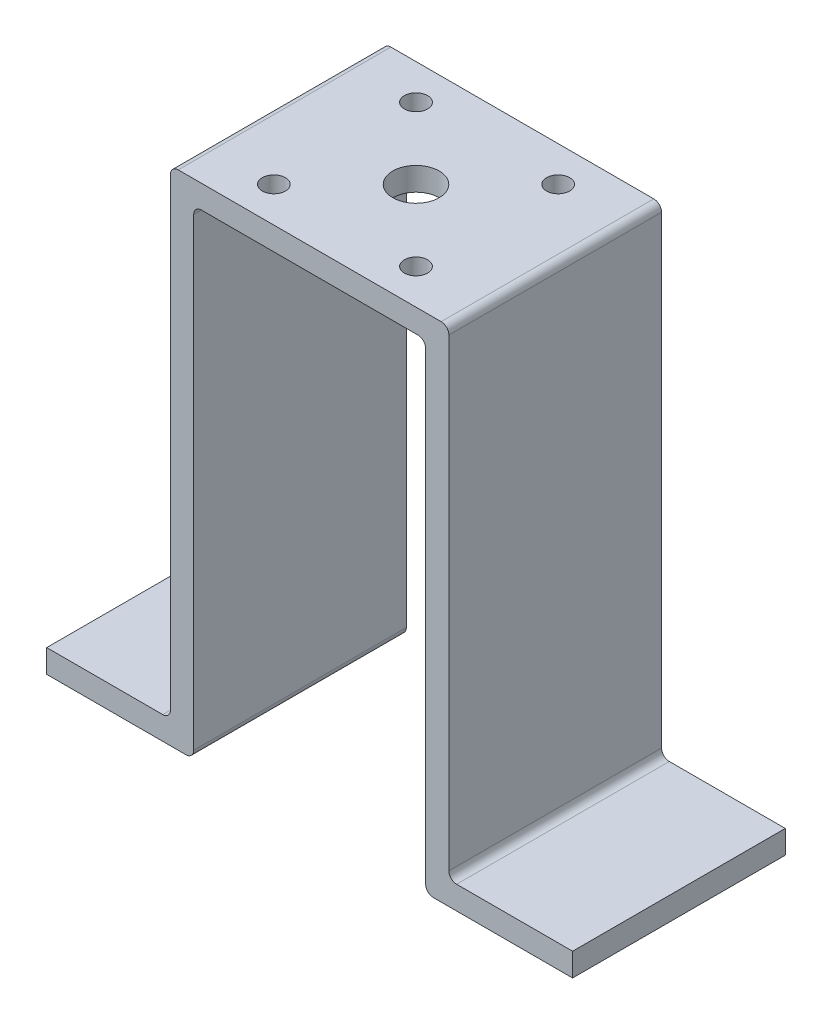
ISO-10303-21;
HEADER;
FILE_DESCRIPTION(('STEP AP214'),'2;1');
FILE_NAME('part.step','',(''),(''),'','','');
FILE_SCHEMA(('AUTOMOTIVE_DESIGN { 1 0 10303 214 1 1 1 1 }'));
ENDSEC;
DATA;
#1=APPLICATION_CONTEXT('core data for automotive mechanical design processes');
#2=APPLICATION_PROTOCOL_DEFINITION('international standard','automotive_design',2000,#1);
#3=PRODUCT_CONTEXT('',#1,'mechanical');
#4=PRODUCT('Part','Part','',(#3));
#5=PRODUCT_RELATED_PRODUCT_CATEGORY('part','',(#4));
#6=PRODUCT_DEFINITION_FORMATION('','',#4);
#7=PRODUCT_DEFINITION_CONTEXT('part definition',#1,'design');
#8=PRODUCT_DEFINITION('design','',#6,#7);
#9=PRODUCT_DEFINITION_SHAPE('','',#8);
#10=(LENGTH_UNIT() NAMED_UNIT(*) SI_UNIT(.MILLI.,.METRE.));
#11=(NAMED_UNIT(*) PLANE_ANGLE_UNIT() SI_UNIT($,.RADIAN.));
#12=(NAMED_UNIT(*) SI_UNIT($,.STERADIAN.) SOLID_ANGLE_UNIT());
#13=UNCERTAINTY_MEASURE_WITH_UNIT(LENGTH_MEASURE(1.E-05),#10,'distance_accuracy_value','');
#14=(GEOMETRIC_REPRESENTATION_CONTEXT(3) GLOBAL_UNCERTAINTY_ASSIGNED_CONTEXT((#13)) GLOBAL_UNIT_ASSIGNED_CONTEXT((#10,
#11,#12)) REPRESENTATION_CONTEXT('',''));
#15=CARTESIAN_POINT('',(0.,0.,0.));
#16=DIRECTION('',(0.,0.,1.));
#17=DIRECTION('',(1.,0.,0.));
#18=AXIS2_PLACEMENT_3D('',#15,#16,#17);
#19=CARTESIAN_POINT('',(-17.,40.2950334953585,13.75));
#20=DIRECTION('',(0.,-1.,0.));
#21=DIRECTION('',(0.,0.,-1.));
#22=AXIS2_PLACEMENT_3D('',#19,#20,#21);
#23=PLANE('',#22);
#24=CARTESIAN_POINT('',(-9.19,40.2950334953585,9.19));
#25=DIRECTION('',(0.,1.,0.));
#26=DIRECTION('',(0.,0.,1.));
#27=AXIS2_PLACEMENT_3D('',#24,#25,#26);
#28=CIRCLE('',#27,1.5);
#29=CARTESIAN_POINT('',(-9.19,40.2950334953585,10.69));
#30=VERTEX_POINT('',#29);
#31=EDGE_CURVE('E382',#30,#30,#28,.T.);
#32=ORIENTED_EDGE('',*,*,#31,.F.);
#33=EDGE_LOOP('',(#32));
#34=FACE_BOUND('',#33,.T.);
#35=CARTESIAN_POINT('',(9.19,40.2950334953585,9.19));
#36=DIRECTION('',(0.,1.,0.));
#37=DIRECTION('',(0.,0.,1.));
#38=AXIS2_PLACEMENT_3D('',#35,#36,#37);
#39=CIRCLE('',#38,1.5);
#40=CARTESIAN_POINT('',(9.19,40.2950334953585,10.69));
#41=VERTEX_POINT('',#40);
#42=EDGE_CURVE('E386',#41,#41,#39,.T.);
#43=ORIENTED_EDGE('',*,*,#42,.F.);
#44=EDGE_LOOP('',(#43));
#45=FACE_BOUND('',#44,.T.);
#46=CARTESIAN_POINT('',(9.19,40.2950334953585,-9.19));
#47=DIRECTION('',(0.,1.,0.));
#48=DIRECTION('',(0.,0.,1.));
#49=AXIS2_PLACEMENT_3D('',#46,#47,#48);
#50=CIRCLE('',#49,1.5);
#51=CARTESIAN_POINT('',(9.19,40.2950334953585,-7.69));
#52=VERTEX_POINT('',#51);
#53=EDGE_CURVE('E390',#52,#52,#50,.T.);
#54=ORIENTED_EDGE('',*,*,#53,.F.);
#55=EDGE_LOOP('',(#54));
#56=FACE_BOUND('',#55,.T.);
#57=CARTESIAN_POINT('',(-9.19,40.2950334953585,-9.19));
#58=DIRECTION('',(0.,1.,0.));
#59=DIRECTION('',(0.,0.,1.));
#60=AXIS2_PLACEMENT_3D('',#57,#58,#59);
#61=CIRCLE('',#60,1.5);
#62=CARTESIAN_POINT('',(-9.19,40.2950334953585,-7.69));
#63=VERTEX_POINT('',#62);
#64=EDGE_CURVE('E381',#63,#63,#61,.T.);
#65=ORIENTED_EDGE('',*,*,#64,.F.);
#66=EDGE_LOOP('',(#65));
#67=FACE_BOUND('',#66,.T.);
#68=CARTESIAN_POINT('',(0.,40.2950334953585,0.));
#69=DIRECTION('',(0.,1.,0.));
#70=DIRECTION('',(0.,0.,1.));
#71=AXIS2_PLACEMENT_3D('',#68,#69,#70);
#72=CIRCLE('',#71,3.);
#73=CARTESIAN_POINT('',(0.,40.2950334953585,3.));
#74=VERTEX_POINT('',#73);
#75=EDGE_CURVE('E224',#74,#74,#72,.T.);
#76=ORIENTED_EDGE('',*,*,#75,.F.);
#77=EDGE_LOOP('',(#76));
#78=FACE_BOUND('',#77,.T.);
#79=DIRECTION('',(-1.,0.,0.));
#80=VECTOR('',#79,1.);
#81=CARTESIAN_POINT('',(-17.,40.2950334953585,-13.75));
#82=LINE('',#81,#80);
#83=CARTESIAN_POINT('',(17.,40.2950334953585,-13.75));
#84=VERTEX_POINT('',#83);
#85=CARTESIAN_POINT('',(-17.,40.2950334953585,-13.75));
#86=VERTEX_POINT('',#85);
#87=EDGE_CURVE('E162',#84,#86,#82,.T.);
#88=ORIENTED_EDGE('',*,*,#87,.T.);
#89=DIRECTION('',(0.,0.,-1.));
#90=VECTOR('',#89,1.);
#91=CARTESIAN_POINT('',(-17.,40.2950334953585,13.75));
#92=LINE('',#91,#90);
#93=CARTESIAN_POINT('',(-17.,40.2950334953585,13.75));
#94=VERTEX_POINT('',#93);
#95=EDGE_CURVE('E11',#94,#86,#92,.T.);
#96=ORIENTED_EDGE('',*,*,#95,.F.);
#97=DIRECTION('',(-1.,0.,0.));
#98=VECTOR('',#97,1.);
#99=CARTESIAN_POINT('',(-17.,40.2950334953585,13.75));
#100=LINE('',#99,#98);
#101=CARTESIAN_POINT('',(17.,40.2950334953585,13.75));
#102=VERTEX_POINT('',#101);
#103=EDGE_CURVE('E108',#102,#94,#100,.T.);
#104=ORIENTED_EDGE('',*,*,#103,.F.);
#105=DIRECTION('',(0.,0.,-1.));
#106=VECTOR('',#105,1.);
#107=CARTESIAN_POINT('',(17.,40.2950334953585,13.75));
#108=LINE('',#107,#106);
#109=EDGE_CURVE('E285',#102,#84,#108,.T.);
#110=ORIENTED_EDGE('',*,*,#109,.T.);
#111=EDGE_LOOP('',(#88,#96,#104,#110));
#112=FACE_BOUND('',#111,.T.);
#113=ADVANCED_FACE('F39',(#34,#45,#56,#67,#78,#112),#23,.F.);
#114=CARTESIAN_POINT('',(-17.,39.2950334953585,13.75));
#115=DIRECTION('',(0.,0.,-1.));
#116=DIRECTION('',(-1.,0.,0.));
#117=AXIS2_PLACEMENT_3D('',#114,#115,#116);
#118=CYLINDRICAL_SURFACE('',#117,1.);
#119=CARTESIAN_POINT('',(-17.,39.2950334953585,-13.75));
#120=DIRECTION('',(0.,0.,1.));
#121=DIRECTION('',(-1.,0.,0.));
#122=AXIS2_PLACEMENT_3D('',#119,#120,#121);
#123=CIRCLE('',#122,1.);
#124=CARTESIAN_POINT('',(-18.,39.2950334953585,-13.75));
#125=VERTEX_POINT('',#124);
#126=EDGE_CURVE('E165',#86,#125,#123,.T.);
#127=ORIENTED_EDGE('',*,*,#126,.T.);
#128=DIRECTION('',(0.,0.,-1.));
#129=VECTOR('',#128,1.);
#130=CARTESIAN_POINT('',(-18.,39.2950334953585,13.75));
#131=LINE('',#130,#129);
#132=CARTESIAN_POINT('',(-18.,39.2950334953585,13.75));
#133=VERTEX_POINT('',#132);
#134=EDGE_CURVE('E49',#133,#125,#131,.T.);
#135=ORIENTED_EDGE('',*,*,#134,.F.);
#136=CARTESIAN_POINT('',(-17.,39.2950334953585,13.75));
#137=DIRECTION('',(0.,0.,1.));
#138=DIRECTION('',(-1.,0.,0.));
#139=AXIS2_PLACEMENT_3D('',#136,#137,#138);
#140=CIRCLE('',#139,1.);
#141=EDGE_CURVE('E326',#94,#133,#140,.T.);
#142=ORIENTED_EDGE('',*,*,#141,.F.);
#143=ORIENTED_EDGE('',*,*,#95,.T.);
#144=EDGE_LOOP('',(#127,#135,#142,#143));
#145=FACE_BOUND('',#144,.T.);
#146=ADVANCED_FACE('F403',(#145),#118,.T.);
#147=CARTESIAN_POINT('',(-18.,-20.7049665046415,13.75));
#148=DIRECTION('',(1.,0.,0.));
#149=DIRECTION('',(0.,1.,0.));
#150=AXIS2_PLACEMENT_3D('',#147,#148,#149);
#151=PLANE('',#150);
#152=DIRECTION('',(0.,-1.,0.));
#153=VECTOR('',#152,1.);
#154=CARTESIAN_POINT('',(-18.,-20.7049665046415,-13.75));
#155=LINE('',#154,#153);
#156=CARTESIAN_POINT('',(-18.,-20.7049665046415,-13.75));
#157=VERTEX_POINT('',#156);
#158=EDGE_CURVE('E169',#125,#157,#155,.T.);
#159=ORIENTED_EDGE('',*,*,#158,.T.);
#160=DIRECTION('',(0.,0.,-1.));
#161=VECTOR('',#160,1.);
#162=CARTESIAN_POINT('',(-18.,-20.7049665046415,13.75));
#163=LINE('',#162,#161);
#164=CARTESIAN_POINT('',(-18.,-20.7049665046415,13.75));
#165=VERTEX_POINT('',#164);
#166=EDGE_CURVE('E212',#165,#157,#163,.T.);
#167=ORIENTED_EDGE('',*,*,#166,.F.);
#168=DIRECTION('',(0.,-1.,0.));
#169=VECTOR('',#168,1.);
#170=CARTESIAN_POINT('',(-18.,-20.7049665046415,13.75));
#171=LINE('',#170,#169);
#172=EDGE_CURVE('E329',#133,#165,#171,.T.);
#173=ORIENTED_EDGE('',*,*,#172,.F.);
#174=ORIENTED_EDGE('',*,*,#134,.T.);
#175=EDGE_LOOP('',(#159,#167,#173,#174));
#176=FACE_BOUND('',#175,.T.);
#177=ADVANCED_FACE('F420',(#176),#151,.F.);
#178=CARTESIAN_POINT('',(-19.,-20.7049665046415,13.75));
#179=DIRECTION('',(0.,0.,-1.));
#180=DIRECTION('',(-1.,0.,0.));
#181=AXIS2_PLACEMENT_3D('',#178,#179,#180);
#182=CYLINDRICAL_SURFACE('',#181,1.);
#183=CARTESIAN_POINT('',(-19.,-20.7049665046415,-13.75));
#184=DIRECTION('',(0.,0.,-1.));
#185=DIRECTION('',(1.,0.,0.));
#186=AXIS2_PLACEMENT_3D('',#183,#184,#185);
#187=CIRCLE('',#186,1.);
#188=CARTESIAN_POINT('',(-19.,-21.7049665046415,-13.75));
#189=VERTEX_POINT('',#188);
#190=EDGE_CURVE('E172',#157,#189,#187,.T.);
#191=ORIENTED_EDGE('',*,*,#190,.T.);
#192=DIRECTION('',(0.,0.,-1.));
#193=VECTOR('',#192,1.);
#194=CARTESIAN_POINT('',(-19.,-21.7049665046415,13.75));
#195=LINE('',#194,#193);
#196=CARTESIAN_POINT('',(-19.,-21.7049665046415,13.75));
#197=VERTEX_POINT('',#196);
#198=EDGE_CURVE('E208',#197,#189,#195,.T.);
#199=ORIENTED_EDGE('',*,*,#198,.F.);
#200=CARTESIAN_POINT('',(-19.,-20.7049665046415,13.75));
#201=DIRECTION('',(0.,0.,-1.));
#202=DIRECTION('',(1.,0.,0.));
#203=AXIS2_PLACEMENT_3D('',#200,#201,#202);
#204=CIRCLE('',#203,1.);
#205=EDGE_CURVE('E332',#165,#197,#204,.T.);
#206=ORIENTED_EDGE('',*,*,#205,.F.);
#207=ORIENTED_EDGE('',*,*,#166,.T.);
#208=EDGE_LOOP('',(#191,#199,#206,#207));
#209=FACE_BOUND('',#208,.T.);
#210=ADVANCED_FACE('F424',(#209),#182,.F.);
#211=CARTESIAN_POINT('',(-34.,-21.7049665046415,13.75));
#212=DIRECTION('',(0.,-1.,0.));
#213=DIRECTION('',(1.,0.,0.));
#214=AXIS2_PLACEMENT_3D('',#211,#212,#213);
#215=PLANE('',#214);
#216=DIRECTION('',(-1.,0.,0.));
#217=VECTOR('',#216,1.);
#218=CARTESIAN_POINT('',(-34.,-21.7049665046415,-13.75));
#219=LINE('',#218,#217);
#220=CARTESIAN_POINT('',(-34.,-21.7049665046415,-13.75));
#221=VERTEX_POINT('',#220);
#222=EDGE_CURVE('E175',#189,#221,#219,.T.);
#223=ORIENTED_EDGE('',*,*,#222,.T.);
#224=DIRECTION('',(0.,0.,-1.));
#225=VECTOR('',#224,1.);
#226=CARTESIAN_POINT('',(-34.,-21.7049665046415,13.75));
#227=LINE('',#226,#225);
#228=CARTESIAN_POINT('',(-34.,-21.7049665046415,13.75));
#229=VERTEX_POINT('',#228);
#230=EDGE_CURVE('E204',#229,#221,#227,.T.);
#231=ORIENTED_EDGE('',*,*,#230,.F.);
#232=DIRECTION('',(-1.,0.,0.));
#233=VECTOR('',#232,1.);
#234=CARTESIAN_POINT('',(-34.,-21.7049665046415,13.75));
#235=LINE('',#234,#233);
#236=EDGE_CURVE('E335',#197,#229,#235,.T.);
#237=ORIENTED_EDGE('',*,*,#236,.F.);
#238=ORIENTED_EDGE('',*,*,#198,.T.);
#239=EDGE_LOOP('',(#223,#231,#237,#238));
#240=FACE_BOUND('',#239,.T.);
#241=ADVANCED_FACE('F431',(#240),#215,.F.);
#242=CARTESIAN_POINT('',(-34.,-24.7049665046415,13.75));
#243=DIRECTION('',(1.,0.,0.));
#244=DIRECTION('',(0.,0.,-1.));
#245=AXIS2_PLACEMENT_3D('',#242,#243,#244);
#246=PLANE('',#245);
#247=DIRECTION('',(0.,-1.,0.));
#248=VECTOR('',#247,1.);
#249=CARTESIAN_POINT('',(-34.,-24.7049665046415,-13.75));
#250=LINE('',#249,#248);
#251=CARTESIAN_POINT('',(-34.,-24.7049665046415,-13.75));
#252=VERTEX_POINT('',#251);
#253=EDGE_CURVE('E178',#221,#252,#250,.T.);
#254=ORIENTED_EDGE('',*,*,#253,.T.);
#255=DIRECTION('',(0.,0.,-1.));
#256=VECTOR('',#255,1.);
#257=CARTESIAN_POINT('',(-34.,-24.7049665046415,13.75));
#258=LINE('',#257,#256);
#259=CARTESIAN_POINT('',(-34.,-24.7049665046415,13.75));
#260=VERTEX_POINT('',#259);
#261=EDGE_CURVE('E200',#260,#252,#258,.T.);
#262=ORIENTED_EDGE('',*,*,#261,.F.);
#263=DIRECTION('',(0.,-1.,0.));
#264=VECTOR('',#263,1.);
#265=CARTESIAN_POINT('',(-34.,-24.7049665046415,13.75));
#266=LINE('',#265,#264);
#267=EDGE_CURVE('E338',#229,#260,#266,.T.);
#268=ORIENTED_EDGE('',*,*,#267,.F.);
#269=ORIENTED_EDGE('',*,*,#230,.T.);
#270=EDGE_LOOP('',(#254,#262,#268,#269));
#271=FACE_BOUND('',#270,.T.);
#272=ADVANCED_FACE('F434',(#271),#246,.F.);
#273=CARTESIAN_POINT('',(-16.,-24.7049665046415,13.75));
#274=DIRECTION('',(0.,1.,0.));
#275=DIRECTION('',(0.,0.,1.));
#276=AXIS2_PLACEMENT_3D('',#273,#274,#275);
#277=PLANE('',#276);
#278=DIRECTION('',(1.,0.,0.));
#279=VECTOR('',#278,1.);
#280=CARTESIAN_POINT('',(-16.,-24.7049665046415,-13.75));
#281=LINE('',#280,#279);
#282=CARTESIAN_POINT('',(-16.,-24.7049665046415,-13.75));
#283=VERTEX_POINT('',#282);
#284=EDGE_CURVE('E181',#252,#283,#281,.T.);
#285=ORIENTED_EDGE('',*,*,#284,.T.);
#286=DIRECTION('',(0.,0.,-1.));
#287=VECTOR('',#286,1.);
#288=CARTESIAN_POINT('',(-16.,-24.7049665046415,13.75));
#289=LINE('',#288,#287);
#290=CARTESIAN_POINT('',(-16.,-24.7049665046415,13.75));
#291=VERTEX_POINT('',#290);
#292=EDGE_CURVE('E148',#291,#283,#289,.T.);
#293=ORIENTED_EDGE('',*,*,#292,.F.);
#294=DIRECTION('',(1.,0.,0.));
#295=VECTOR('',#294,1.);
#296=CARTESIAN_POINT('',(-16.,-24.7049665046415,13.75));
#297=LINE('',#296,#295);
#298=EDGE_CURVE('E137',#260,#291,#297,.T.);
#299=ORIENTED_EDGE('',*,*,#298,.F.);
#300=ORIENTED_EDGE('',*,*,#261,.T.);
#301=EDGE_LOOP('',(#285,#293,#299,#300));
#302=FACE_BOUND('',#301,.T.);
#303=ADVANCED_FACE('F437',(#302),#277,.F.);
#304=CARTESIAN_POINT('',(-16.,-23.7049665046415,13.75));
#305=DIRECTION('',(0.,0.,-1.));
#306=DIRECTION('',(-1.,0.,0.));
#307=AXIS2_PLACEMENT_3D('',#304,#305,#306);
#308=CYLINDRICAL_SURFACE('',#307,1.);
#309=CARTESIAN_POINT('',(-16.,-23.7049665046415,-13.75));
#310=DIRECTION('',(0.,0.,1.));
#311=DIRECTION('',(-1.,0.,0.));
#312=AXIS2_PLACEMENT_3D('',#309,#310,#311);
#313=CIRCLE('',#312,1.);
#314=CARTESIAN_POINT('',(-15.,-23.7049665046415,-13.75));
#315=VERTEX_POINT('',#314);
#316=EDGE_CURVE('E146',#283,#315,#313,.T.);
#317=ORIENTED_EDGE('',*,*,#316,.T.);
#318=DIRECTION('',(0.,0.,-1.));
#319=VECTOR('',#318,1.);
#320=CARTESIAN_POINT('',(-15.,-23.7049665046415,13.75));
#321=LINE('',#320,#319);
#322=CARTESIAN_POINT('',(-15.,-23.7049665046415,13.75));
#323=VERTEX_POINT('',#322);
#324=EDGE_CURVE('E143',#323,#315,#321,.T.);
#325=ORIENTED_EDGE('',*,*,#324,.F.);
#326=CARTESIAN_POINT('',(-16.,-23.7049665046415,13.75));
#327=DIRECTION('',(0.,0.,1.));
#328=DIRECTION('',(-1.,0.,0.));
#329=AXIS2_PLACEMENT_3D('',#326,#327,#328);
#330=CIRCLE('',#329,1.);
#331=EDGE_CURVE('E131',#291,#323,#330,.T.);
#332=ORIENTED_EDGE('',*,*,#331,.F.);
#333=ORIENTED_EDGE('',*,*,#292,.T.);
#334=EDGE_LOOP('',(#317,#325,#332,#333));
#335=FACE_BOUND('',#334,.T.);
#336=ADVANCED_FACE('F144',(#335),#308,.T.);
#337=CARTESIAN_POINT('',(-15.,36.2950334953585,13.75));
#338=DIRECTION('',(-1.,0.,0.));
#339=DIRECTION('',(0.,-1.,0.));
#340=AXIS2_PLACEMENT_3D('',#337,#338,#339);
#341=PLANE('',#340);
#342=DIRECTION('',(0.,1.,0.));
#343=VECTOR('',#342,1.);
#344=CARTESIAN_POINT('',(-15.,36.2950334953585,-13.75));
#345=LINE('',#344,#343);
#346=CARTESIAN_POINT('',(-15.,36.2950334953585,-13.75));
#347=VERTEX_POINT('',#346);
#348=EDGE_CURVE('E94',#315,#347,#345,.T.);
#349=ORIENTED_EDGE('',*,*,#348,.T.);
#350=DIRECTION('',(0.,0.,-1.));
#351=VECTOR('',#350,1.);
#352=CARTESIAN_POINT('',(-15.,36.2950334953585,13.75));
#353=LINE('',#352,#351);
#354=CARTESIAN_POINT('',(-15.,36.2950334953585,13.75));
#355=VERTEX_POINT('',#354);
#356=EDGE_CURVE('E149',#355,#347,#353,.T.);
#357=ORIENTED_EDGE('',*,*,#356,.F.);
#358=DIRECTION('',(0.,1.,0.));
#359=VECTOR('',#358,1.);
#360=CARTESIAN_POINT('',(-15.,36.2950334953585,13.75));
#361=LINE('',#360,#359);
#362=EDGE_CURVE('E135',#323,#355,#361,.T.);
#363=ORIENTED_EDGE('',*,*,#362,.F.);
#364=ORIENTED_EDGE('',*,*,#324,.T.);
#365=EDGE_LOOP('',(#349,#357,#363,#364));
#366=FACE_BOUND('',#365,.T.);
#367=ADVANCED_FACE('F151',(#366),#341,.F.);
#368=CARTESIAN_POINT('',(-14.,36.2950334953585,13.75));
#369=DIRECTION('',(0.,0.,-1.));
#370=DIRECTION('',(-1.,0.,0.));
#371=AXIS2_PLACEMENT_3D('',#368,#369,#370);
#372=CYLINDRICAL_SURFACE('',#371,1.);
#373=CARTESIAN_POINT('',(-14.,36.2950334953585,-13.75));
#374=DIRECTION('',(0.,0.,-1.));
#375=DIRECTION('',(1.,0.,0.));
#376=AXIS2_PLACEMENT_3D('',#373,#374,#375);
#377=CIRCLE('',#376,1.);
#378=CARTESIAN_POINT('',(-14.,37.2950334953585,-13.75));
#379=VERTEX_POINT('',#378);
#380=EDGE_CURVE('E100',#347,#379,#377,.T.);
#381=ORIENTED_EDGE('',*,*,#380,.T.);
#382=DIRECTION('',(0.,0.,-1.));
#383=VECTOR('',#382,1.);
#384=CARTESIAN_POINT('',(-14.,37.2950334953585,13.75));
#385=LINE('',#384,#383);
#386=CARTESIAN_POINT('',(-14.,37.2950334953585,13.75));
#387=VERTEX_POINT('',#386);
#388=EDGE_CURVE('E161',#387,#379,#385,.T.);
#389=ORIENTED_EDGE('',*,*,#388,.F.);
#390=CARTESIAN_POINT('',(-14.,36.2950334953585,13.75));
#391=DIRECTION('',(0.,0.,-1.));
#392=DIRECTION('',(1.,0.,0.));
#393=AXIS2_PLACEMENT_3D('',#390,#391,#392);
#394=CIRCLE('',#393,1.);
#395=EDGE_CURVE('E58',#355,#387,#394,.T.);
#396=ORIENTED_EDGE('',*,*,#395,.F.);
#397=ORIENTED_EDGE('',*,*,#356,.T.);
#398=EDGE_LOOP('',(#381,#389,#396,#397));
#399=FACE_BOUND('',#398,.T.);
#400=ADVANCED_FACE('F532',(#399),#372,.F.);
#401=CARTESIAN_POINT('',(0.,37.2950334953585,13.75));
#402=DIRECTION('',(0.,1.,0.));
#403=DIRECTION('',(0.,0.,1.));
#404=AXIS2_PLACEMENT_3D('',#401,#402,#403);
#405=PLANE('',#404);
#406=CARTESIAN_POINT('',(-9.19,37.2950334953585,9.19));
#407=DIRECTION('',(0.,1.,0.));
#408=DIRECTION('',(0.,0.,1.));
#409=AXIS2_PLACEMENT_3D('',#406,#407,#408);
#410=CIRCLE('',#409,1.5);
#411=CARTESIAN_POINT('',(-9.19,37.2950334953585,10.69));
#412=VERTEX_POINT('',#411);
#413=EDGE_CURVE('E42',#412,#412,#410,.T.);
#414=ORIENTED_EDGE('',*,*,#413,.T.);
#415=EDGE_LOOP('',(#414));
#416=FACE_BOUND('',#415,.T.);
#417=CARTESIAN_POINT('',(9.19,37.2950334953585,9.19));
#418=DIRECTION('',(0.,1.,0.));
#419=DIRECTION('',(0.,0.,1.));
#420=AXIS2_PLACEMENT_3D('',#417,#418,#419);
#421=CIRCLE('',#420,1.5);
#422=CARTESIAN_POINT('',(9.19,37.2950334953585,10.69));
#423=VERTEX_POINT('',#422);
#424=EDGE_CURVE('E231',#423,#423,#421,.T.);
#425=ORIENTED_EDGE('',*,*,#424,.T.);
#426=EDGE_LOOP('',(#425));
#427=FACE_BOUND('',#426,.T.);
#428=CARTESIAN_POINT('',(9.19,37.2950334953585,-9.19));
#429=DIRECTION('',(0.,1.,0.));
#430=DIRECTION('',(0.,0.,1.));
#431=AXIS2_PLACEMENT_3D('',#428,#429,#430);
#432=CIRCLE('',#431,1.5);
#433=CARTESIAN_POINT('',(9.19,37.2950334953585,-7.69));
#434=VERTEX_POINT('',#433);
#435=EDGE_CURVE('E228',#434,#434,#432,.T.);
#436=ORIENTED_EDGE('',*,*,#435,.T.);
#437=EDGE_LOOP('',(#436));
#438=FACE_BOUND('',#437,.T.);
#439=CARTESIAN_POINT('',(-9.19,37.2950334953585,-9.19));
#440=DIRECTION('',(0.,1.,0.));
#441=DIRECTION('',(0.,0.,1.));
#442=AXIS2_PLACEMENT_3D('',#439,#440,#441);
#443=CIRCLE('',#442,1.5);
#444=CARTESIAN_POINT('',(-9.19,37.2950334953585,-7.69));
#445=VERTEX_POINT('',#444);
#446=EDGE_CURVE('E223',#445,#445,#443,.T.);
#447=ORIENTED_EDGE('',*,*,#446,.T.);
#448=EDGE_LOOP('',(#447));
#449=FACE_BOUND('',#448,.T.);
#450=CARTESIAN_POINT('',(0.,37.2950334953585,0.));
#451=DIRECTION('',(0.,1.,0.));
#452=DIRECTION('',(0.,0.,1.));
#453=AXIS2_PLACEMENT_3D('',#450,#451,#452);
#454=CIRCLE('',#453,3.);
#455=CARTESIAN_POINT('',(0.,37.2950334953585,3.));
#456=VERTEX_POINT('',#455);
#457=EDGE_CURVE('E219',#456,#456,#454,.T.);
#458=ORIENTED_EDGE('',*,*,#457,.T.);
#459=EDGE_LOOP('',(#458));
#460=FACE_BOUND('',#459,.T.);
#461=DIRECTION('',(1.,0.,0.));
#462=VECTOR('',#461,1.);
#463=CARTESIAN_POINT('',(0.,37.2950334953585,-13.75));
#464=LINE('',#463,#462);
#465=CARTESIAN_POINT('',(14.,37.2950334953585,-13.75));
#466=VERTEX_POINT('',#465);
#467=EDGE_CURVE('E190',#379,#466,#464,.T.);
#468=ORIENTED_EDGE('',*,*,#467,.T.);
#469=DIRECTION('',(0.,0.,-1.));
#470=VECTOR('',#469,1.);
#471=CARTESIAN_POINT('',(14.,37.2950334953585,13.75));
#472=LINE('',#471,#470);
#473=CARTESIAN_POINT('',(14.,37.2950334953585,13.75));
#474=VERTEX_POINT('',#473);
#475=EDGE_CURVE('E166',#474,#466,#472,.T.);
#476=ORIENTED_EDGE('',*,*,#475,.F.);
#477=DIRECTION('',(1.,0.,0.));
#478=VECTOR('',#477,1.);
#479=CARTESIAN_POINT('',(0.,37.2950334953585,13.75));
#480=LINE('',#479,#478);
#481=EDGE_CURVE('E155',#387,#474,#480,.T.);
#482=ORIENTED_EDGE('',*,*,#481,.F.);
#483=ORIENTED_EDGE('',*,*,#388,.T.);
#484=EDGE_LOOP('',(#468,#476,#482,#483));
#485=FACE_BOUND('',#484,.T.);
#486=ADVANCED_FACE('F440',(#416,#427,#438,#449,#460,#485),#405,.F.);
#487=CARTESIAN_POINT('',(-14.,36.2950334953585,13.75));
#488=DIRECTION('',(0.,0.,1.));
#489=DIRECTION('',(1.,0.,0.));
#490=AXIS2_PLACEMENT_3D('',#487,#488,#489);
#491=PLANE('',#490);
#492=ORIENTED_EDGE('',*,*,#481,.T.);
#493=CARTESIAN_POINT('',(14.,36.2950334953585,13.75));
#494=DIRECTION('',(0.,0.,1.));
#495=DIRECTION('',(-1.,0.,0.));
#496=AXIS2_PLACEMENT_3D('',#493,#494,#495);
#497=CIRCLE('',#496,1.);
#498=CARTESIAN_POINT('',(15.,36.2950334953585,13.75));
#499=VERTEX_POINT('',#498);
#500=EDGE_CURVE('E284',#499,#474,#497,.T.);
#501=ORIENTED_EDGE('',*,*,#500,.F.);
#502=DIRECTION('',(0.,1.,0.));
#503=VECTOR('',#502,1.);
#504=CARTESIAN_POINT('',(15.,36.2950334953585,13.75));
#505=LINE('',#504,#503);
#506=CARTESIAN_POINT('',(15.,-23.7049665046415,13.75));
#507=VERTEX_POINT('',#506);
#508=EDGE_CURVE('E366',#507,#499,#505,.T.);
#509=ORIENTED_EDGE('',*,*,#508,.F.);
#510=CARTESIAN_POINT('',(16.,-23.7049665046415,13.75));
#511=DIRECTION('',(0.,0.,-1.));
#512=DIRECTION('',(1.,0.,0.));
#513=AXIS2_PLACEMENT_3D('',#510,#511,#512);
#514=CIRCLE('',#513,1.);
#515=CARTESIAN_POINT('',(16.,-24.7049665046415,13.75));
#516=VERTEX_POINT('',#515);
#517=EDGE_CURVE('E362',#516,#507,#514,.T.);
#518=ORIENTED_EDGE('',*,*,#517,.F.);
#519=DIRECTION('',(-1.,0.,0.));
#520=VECTOR('',#519,1.);
#521=CARTESIAN_POINT('',(16.,-24.7049665046415,13.75));
#522=LINE('',#521,#520);
#523=CARTESIAN_POINT('',(34.,-24.7049665046415,13.75));
#524=VERTEX_POINT('',#523);
#525=EDGE_CURVE('E358',#524,#516,#522,.T.);
#526=ORIENTED_EDGE('',*,*,#525,.F.);
#527=DIRECTION('',(0.,-1.,0.));
#528=VECTOR('',#527,1.);
#529=CARTESIAN_POINT('',(34.,-24.7049665046415,13.75));
#530=LINE('',#529,#528);
#531=CARTESIAN_POINT('',(34.,-21.7049665046415,13.75));
#532=VERTEX_POINT('',#531);
#533=EDGE_CURVE('E354',#532,#524,#530,.T.);
#534=ORIENTED_EDGE('',*,*,#533,.F.);
#535=DIRECTION('',(1.,0.,0.));
#536=VECTOR('',#535,1.);
#537=CARTESIAN_POINT('',(34.,-21.7049665046415,13.75));
#538=LINE('',#537,#536);
#539=CARTESIAN_POINT('',(19.,-21.7049665046415,13.75));
#540=VERTEX_POINT('',#539);
#541=EDGE_CURVE('E350',#540,#532,#538,.T.);
#542=ORIENTED_EDGE('',*,*,#541,.F.);
#543=CARTESIAN_POINT('',(19.,-20.7049665046415,13.75));
#544=DIRECTION('',(0.,0.,1.));
#545=DIRECTION('',(-1.,0.,0.));
#546=AXIS2_PLACEMENT_3D('',#543,#544,#545);
#547=CIRCLE('',#546,1.);
#548=CARTESIAN_POINT('',(18.,-20.7049665046415,13.75));
#549=VERTEX_POINT('',#548);
#550=EDGE_CURVE('E347',#549,#540,#547,.T.);
#551=ORIENTED_EDGE('',*,*,#550,.F.);
#552=DIRECTION('',(0.,-1.,0.));
#553=VECTOR('',#552,1.);
#554=CARTESIAN_POINT('',(18.,-20.7049665046415,13.75));
#555=LINE('',#554,#553);
#556=CARTESIAN_POINT('',(18.,39.2950334953585,13.75));
#557=VERTEX_POINT('',#556);
#558=EDGE_CURVE('E344',#557,#549,#555,.T.);
#559=ORIENTED_EDGE('',*,*,#558,.F.);
#560=CARTESIAN_POINT('',(17.,39.2950334953585,13.75));
#561=DIRECTION('',(0.,0.,-1.));
#562=DIRECTION('',(1.,0.,0.));
#563=AXIS2_PLACEMENT_3D('',#560,#561,#562);
#564=CIRCLE('',#563,1.);
#565=EDGE_CURVE('E254',#102,#557,#564,.T.);
#566=ORIENTED_EDGE('',*,*,#565,.F.);
#567=ORIENTED_EDGE('',*,*,#103,.T.);
#568=ORIENTED_EDGE('',*,*,#141,.T.);
#569=ORIENTED_EDGE('',*,*,#172,.T.);
#570=ORIENTED_EDGE('',*,*,#205,.T.);
#571=ORIENTED_EDGE('',*,*,#236,.T.);
#572=ORIENTED_EDGE('',*,*,#267,.T.);
#573=ORIENTED_EDGE('',*,*,#298,.T.);
#574=ORIENTED_EDGE('',*,*,#331,.T.);
#575=ORIENTED_EDGE('',*,*,#362,.T.);
#576=ORIENTED_EDGE('',*,*,#395,.T.);
#577=EDGE_LOOP('',(#492,#501,#509,#518,#526,#534,#542,#551,#559,#566,#567,#568,#569,#570,#571,
#572,#573,#574,#575,#576));
#578=FACE_BOUND('',#577,.T.);
#579=ADVANCED_FACE('F133',(#578),#491,.T.);
#580=CARTESIAN_POINT('',(-14.,36.2950334953585,-13.75));
#581=DIRECTION('',(0.,0.,1.));
#582=DIRECTION('',(1.,0.,0.));
#583=AXIS2_PLACEMENT_3D('',#580,#581,#582);
#584=PLANE('',#583);
#585=ORIENTED_EDGE('',*,*,#87,.F.);
#586=CARTESIAN_POINT('',(17.,39.2950334953585,-13.75));
#587=DIRECTION('',(0.,0.,-1.));
#588=DIRECTION('',(1.,0.,0.));
#589=AXIS2_PLACEMENT_3D('',#586,#587,#588);
#590=CIRCLE('',#589,1.);
#591=CARTESIAN_POINT('',(18.,39.2950334953585,-13.75));
#592=VERTEX_POINT('',#591);
#593=EDGE_CURVE('E280',#84,#592,#590,.T.);
#594=ORIENTED_EDGE('',*,*,#593,.T.);
#595=DIRECTION('',(0.,-1.,0.));
#596=VECTOR('',#595,1.);
#597=CARTESIAN_POINT('',(18.,-20.7049665046415,-13.75));
#598=LINE('',#597,#596);
#599=CARTESIAN_POINT('',(18.,-20.7049665046415,-13.75));
#600=VERTEX_POINT('',#599);
#601=EDGE_CURVE('E276',#592,#600,#598,.T.);
#602=ORIENTED_EDGE('',*,*,#601,.T.);
#603=CARTESIAN_POINT('',(19.,-20.7049665046415,-13.75));
#604=DIRECTION('',(0.,0.,1.));
#605=DIRECTION('',(-1.,0.,0.));
#606=AXIS2_PLACEMENT_3D('',#603,#604,#605);
#607=CIRCLE('',#606,1.);
#608=CARTESIAN_POINT('',(19.,-21.7049665046415,-13.75));
#609=VERTEX_POINT('',#608);
#610=EDGE_CURVE('E272',#600,#609,#607,.T.);
#611=ORIENTED_EDGE('',*,*,#610,.T.);
#612=DIRECTION('',(1.,0.,0.));
#613=VECTOR('',#612,1.);
#614=CARTESIAN_POINT('',(34.,-21.7049665046415,-13.75));
#615=LINE('',#614,#613);
#616=CARTESIAN_POINT('',(34.,-21.7049665046415,-13.75));
#617=VERTEX_POINT('',#616);
#618=EDGE_CURVE('E268',#609,#617,#615,.T.);
#619=ORIENTED_EDGE('',*,*,#618,.T.);
#620=DIRECTION('',(0.,-1.,0.));
#621=VECTOR('',#620,1.);
#622=CARTESIAN_POINT('',(34.,-24.7049665046415,-13.75));
#623=LINE('',#622,#621);
#624=CARTESIAN_POINT('',(34.,-24.7049665046415,-13.75));
#625=VERTEX_POINT('',#624);
#626=EDGE_CURVE('E264',#617,#625,#623,.T.);
#627=ORIENTED_EDGE('',*,*,#626,.T.);
#628=DIRECTION('',(-1.,0.,0.));
#629=VECTOR('',#628,1.);
#630=CARTESIAN_POINT('',(16.,-24.7049665046415,-13.75));
#631=LINE('',#630,#629);
#632=CARTESIAN_POINT('',(16.,-24.7049665046415,-13.75));
#633=VERTEX_POINT('',#632);
#634=EDGE_CURVE('E260',#625,#633,#631,.T.);
#635=ORIENTED_EDGE('',*,*,#634,.T.);
#636=CARTESIAN_POINT('',(16.,-23.7049665046415,-13.75));
#637=DIRECTION('',(0.,0.,-1.));
#638=DIRECTION('',(1.,0.,0.));
#639=AXIS2_PLACEMENT_3D('',#636,#637,#638);
#640=CIRCLE('',#639,1.);
#641=CARTESIAN_POINT('',(15.,-23.7049665046415,-13.75));
#642=VERTEX_POINT('',#641);
#643=EDGE_CURVE('E251',#633,#642,#640,.T.);
#644=ORIENTED_EDGE('',*,*,#643,.T.);
#645=DIRECTION('',(0.,1.,0.));
#646=VECTOR('',#645,1.);
#647=CARTESIAN_POINT('',(15.,36.2950334953585,-13.75));
#648=LINE('',#647,#646);
#649=CARTESIAN_POINT('',(15.,36.2950334953585,-13.75));
#650=VERTEX_POINT('',#649);
#651=EDGE_CURVE('E243',#642,#650,#648,.T.);
#652=ORIENTED_EDGE('',*,*,#651,.T.);
#653=CARTESIAN_POINT('',(14.,36.2950334953585,-13.75));
#654=DIRECTION('',(0.,0.,1.));
#655=DIRECTION('',(-1.,0.,0.));
#656=AXIS2_PLACEMENT_3D('',#653,#654,#655);
#657=CIRCLE('',#656,1.);
#658=EDGE_CURVE('E238',#650,#466,#657,.T.);
#659=ORIENTED_EDGE('',*,*,#658,.T.);
#660=ORIENTED_EDGE('',*,*,#467,.F.);
#661=ORIENTED_EDGE('',*,*,#380,.F.);
#662=ORIENTED_EDGE('',*,*,#348,.F.);
#663=ORIENTED_EDGE('',*,*,#316,.F.);
#664=ORIENTED_EDGE('',*,*,#284,.F.);
#665=ORIENTED_EDGE('',*,*,#253,.F.);
#666=ORIENTED_EDGE('',*,*,#222,.F.);
#667=ORIENTED_EDGE('',*,*,#190,.F.);
#668=ORIENTED_EDGE('',*,*,#158,.F.);
#669=ORIENTED_EDGE('',*,*,#126,.F.);
#670=EDGE_LOOP('',(#585,#594,#602,#611,#619,#627,#635,#644,#652,#659,#660,#661,#662,#663,#664,
#665,#666,#667,#668,#669));
#671=FACE_BOUND('',#670,.T.);
#672=ADVANCED_FACE('F415',(#671),#584,.F.);
#673=CARTESIAN_POINT('',(14.,36.2950334953585,13.75));
#674=DIRECTION('',(0.,0.,-1.));
#675=DIRECTION('',(-1.,0.,0.));
#676=AXIS2_PLACEMENT_3D('',#673,#674,#675);
#677=CYLINDRICAL_SURFACE('',#676,1.);
#678=ORIENTED_EDGE('',*,*,#658,.F.);
#679=DIRECTION('',(0.,0.,-1.));
#680=VECTOR('',#679,1.);
#681=CARTESIAN_POINT('',(15.,36.2950334953585,13.75));
#682=LINE('',#681,#680);
#683=EDGE_CURVE('E317',#499,#650,#682,.T.);
#684=ORIENTED_EDGE('',*,*,#683,.F.);
#685=ORIENTED_EDGE('',*,*,#500,.T.);
#686=ORIENTED_EDGE('',*,*,#475,.T.);
#687=EDGE_LOOP('',(#678,#684,#685,#686));
#688=FACE_BOUND('',#687,.T.);
#689=ADVANCED_FACE('F444',(#688),#677,.F.);
#690=CARTESIAN_POINT('',(15.,36.2950334953585,13.75));
#691=DIRECTION('',(-1.,0.,0.));
#692=DIRECTION('',(0.,-1.,0.));
#693=AXIS2_PLACEMENT_3D('',#690,#691,#692);
#694=PLANE('',#693);
#695=ORIENTED_EDGE('',*,*,#651,.F.);
#696=DIRECTION('',(0.,0.,-1.));
#697=VECTOR('',#696,1.);
#698=CARTESIAN_POINT('',(15.,-23.7049665046415,13.75));
#699=LINE('',#698,#697);
#700=EDGE_CURVE('E313',#507,#642,#699,.T.);
#701=ORIENTED_EDGE('',*,*,#700,.F.);
#702=ORIENTED_EDGE('',*,*,#508,.T.);
#703=ORIENTED_EDGE('',*,*,#683,.T.);
#704=EDGE_LOOP('',(#695,#701,#702,#703));
#705=FACE_BOUND('',#704,.T.);
#706=ADVANCED_FACE('F452',(#705),#694,.T.);
#707=CARTESIAN_POINT('',(16.,-23.7049665046415,13.75));
#708=DIRECTION('',(0.,0.,-1.));
#709=DIRECTION('',(-1.,0.,0.));
#710=AXIS2_PLACEMENT_3D('',#707,#708,#709);
#711=CYLINDRICAL_SURFACE('',#710,1.);
#712=ORIENTED_EDGE('',*,*,#643,.F.);
#713=DIRECTION('',(0.,0.,-1.));
#714=VECTOR('',#713,1.);
#715=CARTESIAN_POINT('',(16.,-24.7049665046415,13.75));
#716=LINE('',#715,#714);
#717=EDGE_CURVE('E309',#516,#633,#716,.T.);
#718=ORIENTED_EDGE('',*,*,#717,.F.);
#719=ORIENTED_EDGE('',*,*,#517,.T.);
#720=ORIENTED_EDGE('',*,*,#700,.T.);
#721=EDGE_LOOP('',(#712,#718,#719,#720));
#722=FACE_BOUND('',#721,.T.);
#723=ADVANCED_FACE('F513',(#722),#711,.T.);
#724=CARTESIAN_POINT('',(16.,-24.7049665046415,13.75));
#725=DIRECTION('',(0.,-1.,0.));
#726=DIRECTION('',(0.,0.,-1.));
#727=AXIS2_PLACEMENT_3D('',#724,#725,#726);
#728=PLANE('',#727);
#729=ORIENTED_EDGE('',*,*,#634,.F.);
#730=DIRECTION('',(0.,0.,-1.));
#731=VECTOR('',#730,1.);
#732=CARTESIAN_POINT('',(34.,-24.7049665046415,13.75));
#733=LINE('',#732,#731);
#734=EDGE_CURVE('E305',#524,#625,#733,.T.);
#735=ORIENTED_EDGE('',*,*,#734,.F.);
#736=ORIENTED_EDGE('',*,*,#525,.T.);
#737=ORIENTED_EDGE('',*,*,#717,.T.);
#738=EDGE_LOOP('',(#729,#735,#736,#737));
#739=FACE_BOUND('',#738,.T.);
#740=ADVANCED_FACE('F510',(#739),#728,.T.);
#741=CARTESIAN_POINT('',(34.,-24.7049665046415,13.75));
#742=DIRECTION('',(1.,0.,0.));
#743=DIRECTION('',(0.,0.,-1.));
#744=AXIS2_PLACEMENT_3D('',#741,#742,#743);
#745=PLANE('',#744);
#746=ORIENTED_EDGE('',*,*,#626,.F.);
#747=DIRECTION('',(0.,0.,-1.));
#748=VECTOR('',#747,1.);
#749=CARTESIAN_POINT('',(34.,-21.7049665046415,13.75));
#750=LINE('',#749,#748);
#751=EDGE_CURVE('E301',#532,#617,#750,.T.);
#752=ORIENTED_EDGE('',*,*,#751,.F.);
#753=ORIENTED_EDGE('',*,*,#533,.T.);
#754=ORIENTED_EDGE('',*,*,#734,.T.);
#755=EDGE_LOOP('',(#746,#752,#753,#754));
#756=FACE_BOUND('',#755,.T.);
#757=ADVANCED_FACE('F507',(#756),#745,.T.);
#758=CARTESIAN_POINT('',(34.,-21.7049665046415,13.75));
#759=DIRECTION('',(0.,1.,0.));
#760=DIRECTION('',(-1.,0.,0.));
#761=AXIS2_PLACEMENT_3D('',#758,#759,#760);
#762=PLANE('',#761);
#763=ORIENTED_EDGE('',*,*,#618,.F.);
#764=DIRECTION('',(0.,0.,-1.));
#765=VECTOR('',#764,1.);
#766=CARTESIAN_POINT('',(19.,-21.7049665046415,13.75));
#767=LINE('',#766,#765);
#768=EDGE_CURVE('E297',#540,#609,#767,.T.);
#769=ORIENTED_EDGE('',*,*,#768,.F.);
#770=ORIENTED_EDGE('',*,*,#541,.T.);
#771=ORIENTED_EDGE('',*,*,#751,.T.);
#772=EDGE_LOOP('',(#763,#769,#770,#771));
#773=FACE_BOUND('',#772,.T.);
#774=ADVANCED_FACE('F503',(#773),#762,.T.);
#775=CARTESIAN_POINT('',(19.,-20.7049665046415,13.75));
#776=DIRECTION('',(0.,0.,-1.));
#777=DIRECTION('',(-1.,0.,0.));
#778=AXIS2_PLACEMENT_3D('',#775,#776,#777);
#779=CYLINDRICAL_SURFACE('',#778,1.);
#780=ORIENTED_EDGE('',*,*,#610,.F.);
#781=DIRECTION('',(0.,0.,-1.));
#782=VECTOR('',#781,1.);
#783=CARTESIAN_POINT('',(18.,-20.7049665046415,13.75));
#784=LINE('',#783,#782);
#785=EDGE_CURVE('E293',#549,#600,#784,.T.);
#786=ORIENTED_EDGE('',*,*,#785,.F.);
#787=ORIENTED_EDGE('',*,*,#550,.T.);
#788=ORIENTED_EDGE('',*,*,#768,.T.);
#789=EDGE_LOOP('',(#780,#786,#787,#788));
#790=FACE_BOUND('',#789,.T.);
#791=ADVANCED_FACE('F501',(#790),#779,.F.);
#792=CARTESIAN_POINT('',(18.,-20.7049665046415,13.75));
#793=DIRECTION('',(1.,0.,0.));
#794=DIRECTION('',(0.,1.,0.));
#795=AXIS2_PLACEMENT_3D('',#792,#793,#794);
#796=PLANE('',#795);
#797=ORIENTED_EDGE('',*,*,#601,.F.);
#798=DIRECTION('',(0.,0.,-1.));
#799=VECTOR('',#798,1.);
#800=CARTESIAN_POINT('',(18.,39.2950334953585,13.75));
#801=LINE('',#800,#799);
#802=EDGE_CURVE('E289',#557,#592,#801,.T.);
#803=ORIENTED_EDGE('',*,*,#802,.F.);
#804=ORIENTED_EDGE('',*,*,#558,.T.);
#805=ORIENTED_EDGE('',*,*,#785,.T.);
#806=EDGE_LOOP('',(#797,#803,#804,#805));
#807=FACE_BOUND('',#806,.T.);
#808=ADVANCED_FACE('F497',(#807),#796,.T.);
#809=CARTESIAN_POINT('',(17.,39.2950334953585,13.75));
#810=DIRECTION('',(0.,0.,-1.));
#811=DIRECTION('',(-1.,0.,0.));
#812=AXIS2_PLACEMENT_3D('',#809,#810,#811);
#813=CYLINDRICAL_SURFACE('',#812,1.);
#814=ORIENTED_EDGE('',*,*,#593,.F.);
#815=ORIENTED_EDGE('',*,*,#109,.F.);
#816=ORIENTED_EDGE('',*,*,#565,.T.);
#817=ORIENTED_EDGE('',*,*,#802,.T.);
#818=EDGE_LOOP('',(#814,#815,#816,#817));
#819=FACE_BOUND('',#818,.T.);
#820=ADVANCED_FACE('F492',(#819),#813,.T.);
#821=CARTESIAN_POINT('',(0.,-24.7049665046415,0.));
#822=DIRECTION('',(0.,1.,0.));
#823=DIRECTION('',(0.,0.,1.));
#824=AXIS2_PLACEMENT_3D('',#821,#822,#823);
#825=CYLINDRICAL_SURFACE('',#824,3.);
#826=ORIENTED_EDGE('',*,*,#75,.T.);
#827=EDGE_LOOP('',(#826));
#828=FACE_BOUND('',#827,.T.);
#829=ORIENTED_EDGE('',*,*,#457,.F.);
#830=EDGE_LOOP('',(#829));
#831=FACE_BOUND('',#830,.T.);
#832=ADVANCED_FACE('F655',(#828,#831),#825,.F.);
#833=CARTESIAN_POINT('',(-9.19,-24.7049665046415,-9.19));
#834=DIRECTION('',(0.,1.,0.));
#835=DIRECTION('',(0.,0.,1.));
#836=AXIS2_PLACEMENT_3D('',#833,#834,#835);
#837=CYLINDRICAL_SURFACE('',#836,1.5);
#838=ORIENTED_EDGE('',*,*,#64,.T.);
#839=EDGE_LOOP('',(#838));
#840=FACE_BOUND('',#839,.T.);
#841=ORIENTED_EDGE('',*,*,#446,.F.);
#842=EDGE_LOOP('',(#841));
#843=FACE_BOUND('',#842,.T.);
#844=ADVANCED_FACE('F398',(#840,#843),#837,.F.);
#845=CARTESIAN_POINT('',(9.19,-24.7049665046415,-9.19));
#846=DIRECTION('',(0.,1.,0.));
#847=DIRECTION('',(0.,0.,1.));
#848=AXIS2_PLACEMENT_3D('',#845,#846,#847);
#849=CYLINDRICAL_SURFACE('',#848,1.5);
#850=ORIENTED_EDGE('',*,*,#53,.T.);
#851=EDGE_LOOP('',(#850));
#852=FACE_BOUND('',#851,.T.);
#853=ORIENTED_EDGE('',*,*,#435,.F.);
#854=EDGE_LOOP('',(#853));
#855=FACE_BOUND('',#854,.T.);
#856=ADVANCED_FACE('F712',(#852,#855),#849,.F.);
#857=CARTESIAN_POINT('',(9.19,-24.7049665046415,9.19));
#858=DIRECTION('',(0.,1.,0.));
#859=DIRECTION('',(0.,0.,1.));
#860=AXIS2_PLACEMENT_3D('',#857,#858,#859);
#861=CYLINDRICAL_SURFACE('',#860,1.5);
#862=ORIENTED_EDGE('',*,*,#42,.T.);
#863=EDGE_LOOP('',(#862));
#864=FACE_BOUND('',#863,.T.);
#865=ORIENTED_EDGE('',*,*,#424,.F.);
#866=EDGE_LOOP('',(#865));
#867=FACE_BOUND('',#866,.T.);
#868=ADVANCED_FACE('F719',(#864,#867),#861,.F.);
#869=CARTESIAN_POINT('',(-9.19,-24.7049665046415,9.19));
#870=DIRECTION('',(0.,1.,0.));
#871=DIRECTION('',(0.,0.,1.));
#872=AXIS2_PLACEMENT_3D('',#869,#870,#871);
#873=CYLINDRICAL_SURFACE('',#872,1.5);
#874=ORIENTED_EDGE('',*,*,#31,.T.);
#875=EDGE_LOOP('',(#874));
#876=FACE_BOUND('',#875,.T.);
#877=ORIENTED_EDGE('',*,*,#413,.F.);
#878=EDGE_LOOP('',(#877));
#879=FACE_BOUND('',#878,.T.);
#880=ADVANCED_FACE('F727',(#876,#879),#873,.F.);
#881=CLOSED_SHELL('',(#113,#146,#177,#210,#241,#272,#303,#336,#367,#400,#486,#579,#672,#689,
#706,#723,#740,#757,#774,#791,#808,#820,#832,#844,#856,#868,#880));
#882=MANIFOLD_SOLID_BREP('B2',#881);
#883=ADVANCED_BREP_SHAPE_REPRESENTATION('',(#18,#882),#14);
#884=SHAPE_DEFINITION_REPRESENTATION(#9,#883);
ENDSEC;
END-ISO-10303-21;
